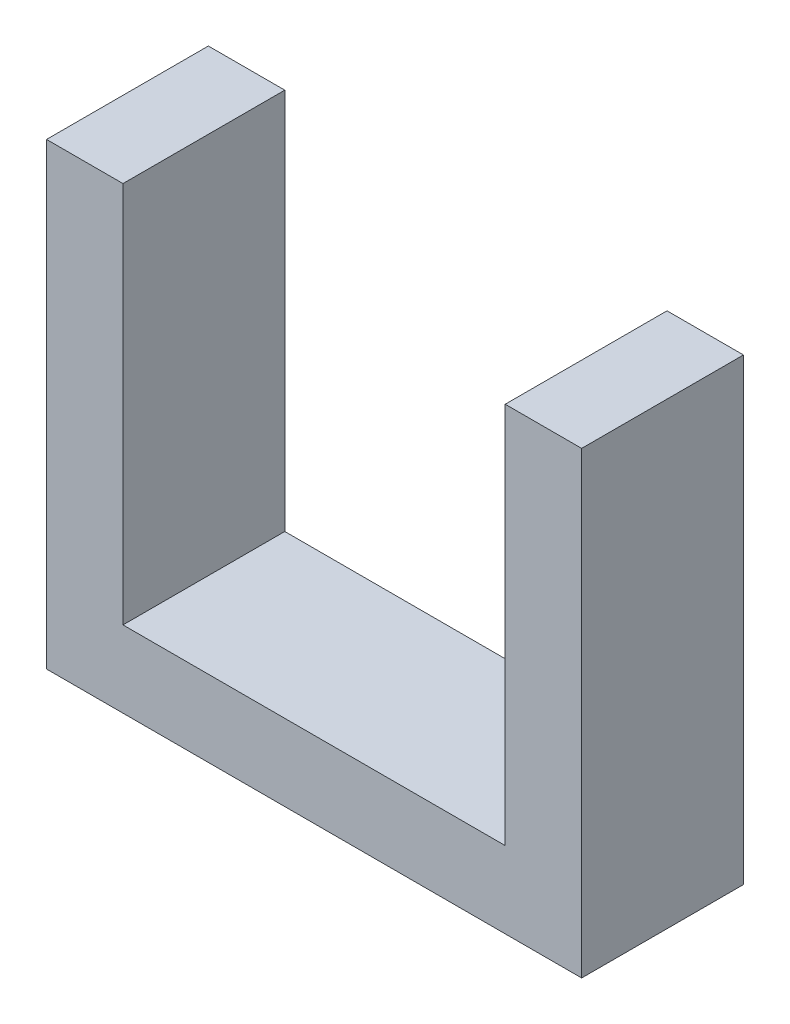
ISO-10303-21;
HEADER;
FILE_DESCRIPTION(('STEP AP214'),'2;1');
FILE_NAME('part.step','',(''),(''),'','','');
FILE_SCHEMA(('AUTOMOTIVE_DESIGN { 1 0 10303 214 1 1 1 1 }'));
ENDSEC;
DATA;
#1=APPLICATION_CONTEXT('core data for automotive mechanical design processes');
#2=APPLICATION_PROTOCOL_DEFINITION('international standard','automotive_design',2000,#1);
#3=PRODUCT_CONTEXT('',#1,'mechanical');
#4=PRODUCT('Part','Part','',(#3));
#5=PRODUCT_RELATED_PRODUCT_CATEGORY('part','',(#4));
#6=PRODUCT_DEFINITION_FORMATION('','',#4);
#7=PRODUCT_DEFINITION_CONTEXT('part definition',#1,'design');
#8=PRODUCT_DEFINITION('design','',#6,#7);
#9=PRODUCT_DEFINITION_SHAPE('','',#8);
#10=(LENGTH_UNIT() NAMED_UNIT(*) SI_UNIT(.MILLI.,.METRE.));
#11=(NAMED_UNIT(*) PLANE_ANGLE_UNIT() SI_UNIT($,.RADIAN.));
#12=(NAMED_UNIT(*) SI_UNIT($,.STERADIAN.) SOLID_ANGLE_UNIT());
#13=UNCERTAINTY_MEASURE_WITH_UNIT(LENGTH_MEASURE(1.E-05),#10,'distance_accuracy_value','');
#14=(GEOMETRIC_REPRESENTATION_CONTEXT(3) GLOBAL_UNCERTAINTY_ASSIGNED_CONTEXT((#13)) GLOBAL_UNIT_ASSIGNED_CONTEXT((#10,
#11,#12)) REPRESENTATION_CONTEXT('',''));
#15=CARTESIAN_POINT('',(0.,0.,0.));
#16=DIRECTION('',(0.,0.,1.));
#17=DIRECTION('',(1.,0.,0.));
#18=AXIS2_PLACEMENT_3D('',#15,#16,#17);
#19=CARTESIAN_POINT('',(-21.2823591503599,18.4603433119444,6.35));
#20=DIRECTION('',(0.,-1.,0.));
#21=DIRECTION('',(0.,0.,-1.));
#22=AXIS2_PLACEMENT_3D('',#19,#20,#21);
#23=PLANE('',#22);
#24=DIRECTION('',(-1.,0.,0.));
#25=VECTOR('',#24,1.);
#26=CARTESIAN_POINT('',(-21.2823591503599,18.4603433119444,0.));
#27=LINE('',#26,#25);
#28=CARTESIAN_POINT('',(-18.2823591503599,18.4603433119444,0.));
#29=VERTEX_POINT('',#28);
#30=CARTESIAN_POINT('',(-21.2823591503599,18.4603433119444,0.));
#31=VERTEX_POINT('',#30);
#32=EDGE_CURVE('E142',#29,#31,#27,.T.);
#33=ORIENTED_EDGE('',*,*,#32,.T.);
#34=DIRECTION('',(0.,0.,-1.));
#35=VECTOR('',#34,1.);
#36=CARTESIAN_POINT('',(-21.2823591503599,18.4603433119444,6.35));
#37=LINE('',#36,#35);
#38=CARTESIAN_POINT('',(-21.2823591503599,18.4603433119444,6.35));
#39=VERTEX_POINT('',#38);
#40=EDGE_CURVE('E11',#39,#31,#37,.T.);
#41=ORIENTED_EDGE('',*,*,#40,.F.);
#42=DIRECTION('',(-1.,0.,0.));
#43=VECTOR('',#42,1.);
#44=CARTESIAN_POINT('',(-21.2823591503599,18.4603433119444,6.35));
#45=LINE('',#44,#43);
#46=CARTESIAN_POINT('',(-18.2823591503599,18.4603433119444,6.35));
#47=VERTEX_POINT('',#46);
#48=EDGE_CURVE('E164',#47,#39,#45,.T.);
#49=ORIENTED_EDGE('',*,*,#48,.F.);
#50=DIRECTION('',(0.,0.,-1.));
#51=VECTOR('',#50,1.);
#52=CARTESIAN_POINT('',(-18.2823591503599,18.4603433119444,6.35));
#53=LINE('',#52,#51);
#54=EDGE_CURVE('E138',#47,#29,#53,.T.);
#55=ORIENTED_EDGE('',*,*,#54,.T.);
#56=EDGE_LOOP('',(#33,#41,#49,#55));
#57=FACE_BOUND('',#56,.T.);
#58=ADVANCED_FACE('F40',(#57),#23,.F.);
#59=CARTESIAN_POINT('',(-21.2823591503599,0.460343311944423,6.35));
#60=DIRECTION('',(1.,0.,0.));
#61=DIRECTION('',(0.,0.,-1.));
#62=AXIS2_PLACEMENT_3D('',#59,#60,#61);
#63=PLANE('',#62);
#64=DIRECTION('',(0.,-1.,0.));
#65=VECTOR('',#64,1.);
#66=CARTESIAN_POINT('',(-21.2823591503599,0.460343311944423,0.));
#67=LINE('',#66,#65);
#68=CARTESIAN_POINT('',(-21.2823591503599,0.460343311944423,0.));
#69=VERTEX_POINT('',#68);
#70=EDGE_CURVE('E146',#31,#69,#67,.T.);
#71=ORIENTED_EDGE('',*,*,#70,.T.);
#72=DIRECTION('',(0.,0.,-1.));
#73=VECTOR('',#72,1.);
#74=CARTESIAN_POINT('',(-21.2823591503599,0.460343311944423,6.35));
#75=LINE('',#74,#73);
#76=CARTESIAN_POINT('',(-21.2823591503599,0.460343311944423,6.35));
#77=VERTEX_POINT('',#76);
#78=EDGE_CURVE('E49',#77,#69,#75,.T.);
#79=ORIENTED_EDGE('',*,*,#78,.F.);
#80=DIRECTION('',(0.,-1.,0.));
#81=VECTOR('',#80,1.);
#82=CARTESIAN_POINT('',(-21.2823591503599,0.460343311944423,6.35));
#83=LINE('',#82,#81);
#84=EDGE_CURVE('E100',#39,#77,#83,.T.);
#85=ORIENTED_EDGE('',*,*,#84,.F.);
#86=ORIENTED_EDGE('',*,*,#40,.T.);
#87=EDGE_LOOP('',(#71,#79,#85,#86));
#88=FACE_BOUND('',#87,.T.);
#89=ADVANCED_FACE('F213',(#88),#63,.F.);
#90=CARTESIAN_POINT('',(-0.282359150359921,0.460343311944425,6.35));
#91=DIRECTION('',(0.,1.,0.));
#92=DIRECTION('',(-1.,0.,0.));
#93=AXIS2_PLACEMENT_3D('',#90,#91,#92);
#94=PLANE('',#93);
#95=DIRECTION('',(1.,0.,0.));
#96=VECTOR('',#95,1.);
#97=CARTESIAN_POINT('',(-0.282359150359921,0.460343311944425,0.));
#98=LINE('',#97,#96);
#99=CARTESIAN_POINT('',(-0.282359150359921,0.460343311944425,0.));
#100=VERTEX_POINT('',#99);
#101=EDGE_CURVE('E149',#69,#100,#98,.T.);
#102=ORIENTED_EDGE('',*,*,#101,.T.);
#103=DIRECTION('',(0.,0.,-1.));
#104=VECTOR('',#103,1.);
#105=CARTESIAN_POINT('',(-0.282359150359921,0.460343311944425,6.35));
#106=LINE('',#105,#104);
#107=CARTESIAN_POINT('',(-0.282359150359921,0.460343311944425,6.35));
#108=VERTEX_POINT('',#107);
#109=EDGE_CURVE('E175',#108,#100,#106,.T.);
#110=ORIENTED_EDGE('',*,*,#109,.F.);
#111=DIRECTION('',(1.,0.,0.));
#112=VECTOR('',#111,1.);
#113=CARTESIAN_POINT('',(-0.282359150359921,0.460343311944425,6.35));
#114=LINE('',#113,#112);
#115=EDGE_CURVE('E186',#77,#108,#114,.T.);
#116=ORIENTED_EDGE('',*,*,#115,.F.);
#117=ORIENTED_EDGE('',*,*,#78,.T.);
#118=EDGE_LOOP('',(#102,#110,#116,#117));
#119=FACE_BOUND('',#118,.T.);
#120=ADVANCED_FACE('F184',(#119),#94,.F.);
#121=CARTESIAN_POINT('',(-0.282359150359924,18.4603433119444,6.35));
#122=DIRECTION('',(-1.,0.,0.));
#123=DIRECTION('',(0.,-1.,0.));
#124=AXIS2_PLACEMENT_3D('',#121,#122,#123);
#125=PLANE('',#124);
#126=DIRECTION('',(0.,1.,0.));
#127=VECTOR('',#126,1.);
#128=CARTESIAN_POINT('',(-0.282359150359924,18.4603433119444,0.));
#129=LINE('',#128,#127);
#130=CARTESIAN_POINT('',(-0.282359150359924,18.4603433119444,0.));
#131=VERTEX_POINT('',#130);
#132=EDGE_CURVE('E152',#100,#131,#129,.T.);
#133=ORIENTED_EDGE('',*,*,#132,.T.);
#134=DIRECTION('',(0.,0.,-1.));
#135=VECTOR('',#134,1.);
#136=CARTESIAN_POINT('',(-0.282359150359924,18.4603433119444,6.35));
#137=LINE('',#136,#135);
#138=CARTESIAN_POINT('',(-0.282359150359924,18.4603433119444,6.35));
#139=VERTEX_POINT('',#138);
#140=EDGE_CURVE('E171',#139,#131,#137,.T.);
#141=ORIENTED_EDGE('',*,*,#140,.F.);
#142=DIRECTION('',(0.,1.,0.));
#143=VECTOR('',#142,1.);
#144=CARTESIAN_POINT('',(-0.282359150359924,18.4603433119444,6.35));
#145=LINE('',#144,#143);
#146=EDGE_CURVE('E199',#108,#139,#145,.T.);
#147=ORIENTED_EDGE('',*,*,#146,.F.);
#148=ORIENTED_EDGE('',*,*,#109,.T.);
#149=EDGE_LOOP('',(#133,#141,#147,#148));
#150=FACE_BOUND('',#149,.T.);
#151=ADVANCED_FACE('F194',(#150),#125,.F.);
#152=CARTESIAN_POINT('',(-3.28235915035991,18.4603433119444,6.35));
#153=DIRECTION('',(0.,-1.,0.));
#154=DIRECTION('',(0.,0.,-1.));
#155=AXIS2_PLACEMENT_3D('',#152,#153,#154);
#156=PLANE('',#155);
#157=DIRECTION('',(-1.,0.,0.));
#158=VECTOR('',#157,1.);
#159=CARTESIAN_POINT('',(-3.28235915035991,18.4603433119444,0.));
#160=LINE('',#159,#158);
#161=CARTESIAN_POINT('',(-3.28235915035991,18.4603433119444,0.));
#162=VERTEX_POINT('',#161);
#163=EDGE_CURVE('E155',#131,#162,#160,.T.);
#164=ORIENTED_EDGE('',*,*,#163,.T.);
#165=DIRECTION('',(0.,0.,-1.));
#166=VECTOR('',#165,1.);
#167=CARTESIAN_POINT('',(-3.28235915035991,18.4603433119444,6.35));
#168=LINE('',#167,#166);
#169=CARTESIAN_POINT('',(-3.28235915035991,18.4603433119444,6.35));
#170=VERTEX_POINT('',#169);
#171=EDGE_CURVE('E130',#170,#162,#168,.T.);
#172=ORIENTED_EDGE('',*,*,#171,.F.);
#173=DIRECTION('',(-1.,0.,0.));
#174=VECTOR('',#173,1.);
#175=CARTESIAN_POINT('',(-3.28235915035991,18.4603433119444,6.35));
#176=LINE('',#175,#174);
#177=EDGE_CURVE('E119',#139,#170,#176,.T.);
#178=ORIENTED_EDGE('',*,*,#177,.F.);
#179=ORIENTED_EDGE('',*,*,#140,.T.);
#180=EDGE_LOOP('',(#164,#172,#178,#179));
#181=FACE_BOUND('',#180,.T.);
#182=ADVANCED_FACE('F197',(#181),#156,.F.);
#183=CARTESIAN_POINT('',(-3.28235915035991,3.46034331194443,6.35));
#184=DIRECTION('',(1.,0.,0.));
#185=DIRECTION('',(0.,0.,-1.));
#186=AXIS2_PLACEMENT_3D('',#183,#184,#185);
#187=PLANE('',#186);
#188=DIRECTION('',(0.,-1.,0.));
#189=VECTOR('',#188,1.);
#190=CARTESIAN_POINT('',(-3.28235915035991,3.46034331194443,0.));
#191=LINE('',#190,#189);
#192=CARTESIAN_POINT('',(-3.28235915035991,3.46034331194443,0.));
#193=VERTEX_POINT('',#192);
#194=EDGE_CURVE('E128',#162,#193,#191,.T.);
#195=ORIENTED_EDGE('',*,*,#194,.T.);
#196=DIRECTION('',(0.,0.,-1.));
#197=VECTOR('',#196,1.);
#198=CARTESIAN_POINT('',(-3.28235915035991,3.46034331194443,6.35));
#199=LINE('',#198,#197);
#200=CARTESIAN_POINT('',(-3.28235915035991,3.46034331194443,6.35));
#201=VERTEX_POINT('',#200);
#202=EDGE_CURVE('E125',#201,#193,#199,.T.);
#203=ORIENTED_EDGE('',*,*,#202,.F.);
#204=DIRECTION('',(0.,-1.,0.));
#205=VECTOR('',#204,1.);
#206=CARTESIAN_POINT('',(-3.28235915035991,3.46034331194443,6.35));
#207=LINE('',#206,#205);
#208=EDGE_CURVE('E113',#170,#201,#207,.T.);
#209=ORIENTED_EDGE('',*,*,#208,.F.);
#210=ORIENTED_EDGE('',*,*,#171,.T.);
#211=EDGE_LOOP('',(#195,#203,#209,#210));
#212=FACE_BOUND('',#211,.T.);
#213=ADVANCED_FACE('F126',(#212),#187,.F.);
#214=CARTESIAN_POINT('',(-18.2823591503599,3.46034331194443,6.35));
#215=DIRECTION('',(0.,-1.,0.));
#216=DIRECTION('',(0.,0.,-1.));
#217=AXIS2_PLACEMENT_3D('',#214,#215,#216);
#218=PLANE('',#217);
#219=DIRECTION('',(-1.,0.,0.));
#220=VECTOR('',#219,1.);
#221=CARTESIAN_POINT('',(-18.2823591503599,3.46034331194443,0.));
#222=LINE('',#221,#220);
#223=CARTESIAN_POINT('',(-18.2823591503599,3.46034331194443,0.));
#224=VERTEX_POINT('',#223);
#225=EDGE_CURVE('E86',#193,#224,#222,.T.);
#226=ORIENTED_EDGE('',*,*,#225,.T.);
#227=DIRECTION('',(0.,0.,-1.));
#228=VECTOR('',#227,1.);
#229=CARTESIAN_POINT('',(-18.2823591503599,3.46034331194443,6.35));
#230=LINE('',#229,#228);
#231=CARTESIAN_POINT('',(-18.2823591503599,3.46034331194443,6.35));
#232=VERTEX_POINT('',#231);
#233=EDGE_CURVE('E131',#232,#224,#230,.T.);
#234=ORIENTED_EDGE('',*,*,#233,.F.);
#235=DIRECTION('',(-1.,0.,0.));
#236=VECTOR('',#235,1.);
#237=CARTESIAN_POINT('',(-18.2823591503599,3.46034331194443,6.35));
#238=LINE('',#237,#236);
#239=EDGE_CURVE('E117',#201,#232,#238,.T.);
#240=ORIENTED_EDGE('',*,*,#239,.F.);
#241=ORIENTED_EDGE('',*,*,#202,.T.);
#242=EDGE_LOOP('',(#226,#234,#240,#241));
#243=FACE_BOUND('',#242,.T.);
#244=ADVANCED_FACE('F133',(#243),#218,.F.);
#245=CARTESIAN_POINT('',(-18.2823591503599,18.4603433119444,6.35));
#246=DIRECTION('',(-1.,0.,0.));
#247=DIRECTION('',(0.,-1.,0.));
#248=AXIS2_PLACEMENT_3D('',#245,#246,#247);
#249=PLANE('',#248);
#250=DIRECTION('',(0.,1.,0.));
#251=VECTOR('',#250,1.);
#252=CARTESIAN_POINT('',(-18.2823591503599,18.4603433119444,0.));
#253=LINE('',#252,#251);
#254=EDGE_CURVE('E92',#224,#29,#253,.T.);
#255=ORIENTED_EDGE('',*,*,#254,.T.);
#256=ORIENTED_EDGE('',*,*,#54,.F.);
#257=DIRECTION('',(0.,1.,0.));
#258=VECTOR('',#257,1.);
#259=CARTESIAN_POINT('',(-18.2823591503599,18.4603433119444,6.35));
#260=LINE('',#259,#258);
#261=EDGE_CURVE('E57',#232,#47,#260,.T.);
#262=ORIENTED_EDGE('',*,*,#261,.F.);
#263=ORIENTED_EDGE('',*,*,#233,.T.);
#264=EDGE_LOOP('',(#255,#256,#262,#263));
#265=FACE_BOUND('',#264,.T.);
#266=ADVANCED_FACE('F229',(#265),#249,.F.);
#267=CARTESIAN_POINT('',(0.,0.,6.35));
#268=DIRECTION('',(0.,0.,-1.));
#269=DIRECTION('',(-1.,0.,0.));
#270=AXIS2_PLACEMENT_3D('',#267,#268,#269);
#271=PLANE('',#270);
#272=ORIENTED_EDGE('',*,*,#48,.T.);
#273=ORIENTED_EDGE('',*,*,#84,.T.);
#274=ORIENTED_EDGE('',*,*,#115,.T.);
#275=ORIENTED_EDGE('',*,*,#146,.T.);
#276=ORIENTED_EDGE('',*,*,#177,.T.);
#277=ORIENTED_EDGE('',*,*,#208,.T.);
#278=ORIENTED_EDGE('',*,*,#239,.T.);
#279=ORIENTED_EDGE('',*,*,#261,.T.);
#280=EDGE_LOOP('',(#272,#273,#274,#275,#276,#277,#278,#279));
#281=FACE_BOUND('',#280,.T.);
#282=ADVANCED_FACE('F115',(#281),#271,.F.);
#283=CARTESIAN_POINT('',(0.,0.,0.));
#284=DIRECTION('',(0.,0.,-1.));
#285=DIRECTION('',(-1.,0.,0.));
#286=AXIS2_PLACEMENT_3D('',#283,#284,#285);
#287=PLANE('',#286);
#288=ORIENTED_EDGE('',*,*,#32,.F.);
#289=ORIENTED_EDGE('',*,*,#254,.F.);
#290=ORIENTED_EDGE('',*,*,#225,.F.);
#291=ORIENTED_EDGE('',*,*,#194,.F.);
#292=ORIENTED_EDGE('',*,*,#163,.F.);
#293=ORIENTED_EDGE('',*,*,#132,.F.);
#294=ORIENTED_EDGE('',*,*,#101,.F.);
#295=ORIENTED_EDGE('',*,*,#70,.F.);
#296=EDGE_LOOP('',(#288,#289,#290,#291,#292,#293,#294,#295));
#297=FACE_BOUND('',#296,.T.);
#298=ADVANCED_FACE('F190',(#297),#287,.T.);
#299=CLOSED_SHELL('',(#58,#89,#120,#151,#182,#213,#244,#266,#282,#298));
#300=MANIFOLD_SOLID_BREP('B2',#299);
#301=ADVANCED_BREP_SHAPE_REPRESENTATION('',(#18,#300),#14);
#302=SHAPE_DEFINITION_REPRESENTATION(#9,#301);
ENDSEC;
END-ISO-10303-21;
